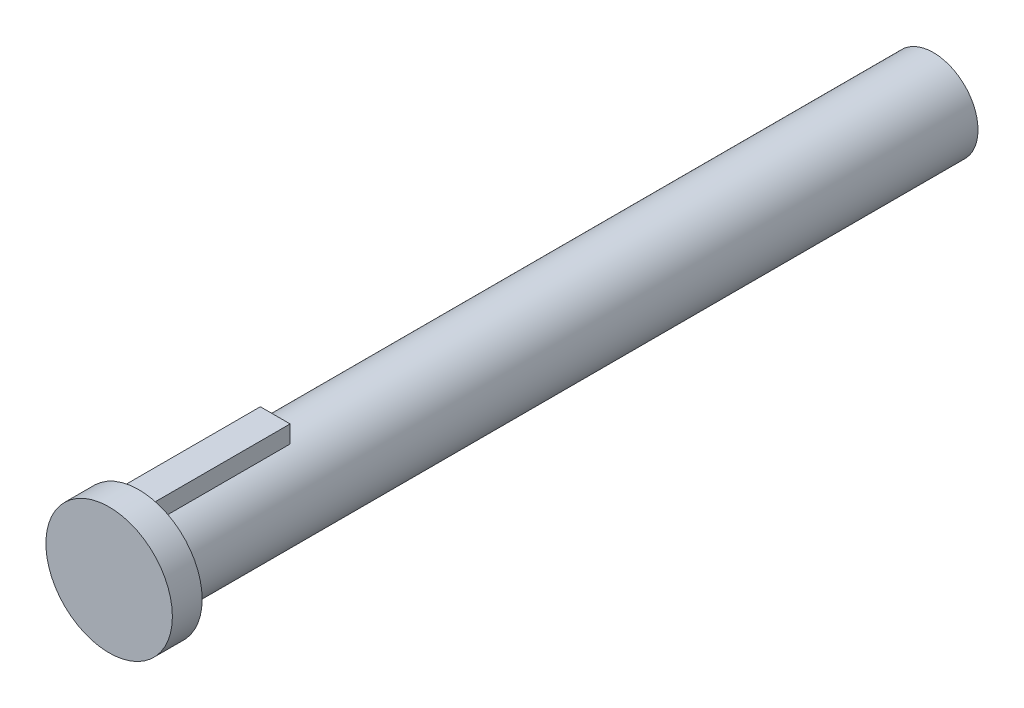
ISO-10303-21;
HEADER;
FILE_DESCRIPTION(('STEP AP214'),'2;1');
FILE_NAME('part.step','',(''),(''),'','','');
FILE_SCHEMA(('AUTOMOTIVE_DESIGN { 1 0 10303 214 1 1 1 1 }'));
ENDSEC;
DATA;
#1=APPLICATION_CONTEXT('core data for automotive mechanical design processes');
#2=APPLICATION_PROTOCOL_DEFINITION('international standard','automotive_design',2000,#1);
#3=PRODUCT_CONTEXT('',#1,'mechanical');
#4=PRODUCT('Part','Part','',(#3));
#5=PRODUCT_RELATED_PRODUCT_CATEGORY('part','',(#4));
#6=PRODUCT_DEFINITION_FORMATION('','',#4);
#7=PRODUCT_DEFINITION_CONTEXT('part definition',#1,'design');
#8=PRODUCT_DEFINITION('design','',#6,#7);
#9=PRODUCT_DEFINITION_SHAPE('','',#8);
#10=(LENGTH_UNIT() NAMED_UNIT(*) SI_UNIT(.MILLI.,.METRE.));
#11=(NAMED_UNIT(*) PLANE_ANGLE_UNIT() SI_UNIT($,.RADIAN.));
#12=(NAMED_UNIT(*) SI_UNIT($,.STERADIAN.) SOLID_ANGLE_UNIT());
#13=UNCERTAINTY_MEASURE_WITH_UNIT(LENGTH_MEASURE(1.E-05),#10,'distance_accuracy_value','');
#14=(GEOMETRIC_REPRESENTATION_CONTEXT(3) GLOBAL_UNCERTAINTY_ASSIGNED_CONTEXT((#13)) GLOBAL_UNIT_ASSIGNED_CONTEXT((#10,
#11,#12)) REPRESENTATION_CONTEXT('',''));
#15=CARTESIAN_POINT('',(0.,0.,0.));
#16=DIRECTION('',(0.,0.,1.));
#17=DIRECTION('',(1.,0.,0.));
#18=AXIS2_PLACEMENT_3D('',#15,#16,#17);
#19=CARTESIAN_POINT('',(0.,0.,53.38));
#20=DIRECTION('',(0.,0.,-1.));
#21=DIRECTION('',(-1.,0.,0.));
#22=AXIS2_PLACEMENT_3D('',#19,#20,#21);
#23=CYLINDRICAL_SURFACE('',#22,3.);
#24=CARTESIAN_POINT('',(0.,0.,53.38));
#25=DIRECTION('',(0.,0.,1.));
#26=DIRECTION('',(1.,0.,0.));
#27=AXIS2_PLACEMENT_3D('',#24,#25,#26);
#28=CIRCLE('',#27,3.);
#29=CARTESIAN_POINT('',(-1.,2.82842712474619,53.38));
#30=VERTEX_POINT('',#29);
#31=CARTESIAN_POINT('',(1.,2.82842712474619,53.38));
#32=VERTEX_POINT('',#31);
#33=EDGE_CURVE('E43',#30,#32,#28,.T.);
#34=ORIENTED_EDGE('',*,*,#33,.F.);
#35=DIRECTION('',(0.,0.,1.));
#36=VECTOR('',#35,1.);
#37=CARTESIAN_POINT('',(-1.,2.82842712474619,44.22));
#38=LINE('',#37,#36);
#39=CARTESIAN_POINT('',(-1.,2.82842712474619,44.22));
#40=VERTEX_POINT('',#39);
#41=EDGE_CURVE('E83',#40,#30,#38,.T.);
#42=ORIENTED_EDGE('',*,*,#41,.F.);
#43=CARTESIAN_POINT('',(0.,0.,44.22));
#44=DIRECTION('',(0.,0.,-1.));
#45=DIRECTION('',(-1.,0.,0.));
#46=AXIS2_PLACEMENT_3D('',#43,#44,#45);
#47=CIRCLE('',#46,3.);
#48=CARTESIAN_POINT('',(1.,2.82842712474619,44.22));
#49=VERTEX_POINT('',#48);
#50=EDGE_CURVE('E11',#40,#49,#47,.T.);
#51=ORIENTED_EDGE('',*,*,#50,.T.);
#52=DIRECTION('',(0.,0.,1.));
#53=VECTOR('',#52,1.);
#54=CARTESIAN_POINT('',(1.,2.82842712474619,44.22));
#55=LINE('',#54,#53);
#56=EDGE_CURVE('E75',#49,#32,#55,.T.);
#57=ORIENTED_EDGE('',*,*,#56,.T.);
#58=EDGE_LOOP('',(#34,#42,#51,#57));
#59=FACE_BOUND('',#58,.T.);
#60=CARTESIAN_POINT('',(0.,0.,0.));
#61=DIRECTION('',(0.,0.,1.));
#62=DIRECTION('',(1.,0.,0.));
#63=AXIS2_PLACEMENT_3D('',#60,#61,#62);
#64=CIRCLE('',#63,3.);
#65=CARTESIAN_POINT('',(3.,0.,0.));
#66=VERTEX_POINT('',#65);
#67=EDGE_CURVE('E87',#66,#66,#64,.T.);
#68=ORIENTED_EDGE('',*,*,#67,.T.);
#69=EDGE_LOOP('',(#68));
#70=FACE_BOUND('',#69,.T.);
#71=ADVANCED_FACE('F35',(#59,#70),#23,.T.);
#72=CARTESIAN_POINT('',(0.,0.,0.));
#73=DIRECTION('',(0.,0.,1.));
#74=DIRECTION('',(1.,0.,0.));
#75=AXIS2_PLACEMENT_3D('',#72,#73,#74);
#76=PLANE('',#75);
#77=ORIENTED_EDGE('',*,*,#67,.F.);
#78=EDGE_LOOP('',(#77));
#79=FACE_BOUND('',#78,.T.);
#80=ADVANCED_FACE('F110',(#79),#76,.F.);
#81=CARTESIAN_POINT('',(-1.,2.82842712474619,44.22));
#82=DIRECTION('',(-1.,0.,0.));
#83=DIRECTION('',(0.,0.,1.));
#84=AXIS2_PLACEMENT_3D('',#81,#82,#83);
#85=PLANE('',#84);
#86=DIRECTION('',(0.,-1.,0.));
#87=VECTOR('',#86,1.);
#88=CARTESIAN_POINT('',(-1.,2.82842712474619,53.38));
#89=LINE('',#88,#87);
#90=CARTESIAN_POINT('',(-1.,3.99842712474619,53.38));
#91=VERTEX_POINT('',#90);
#92=EDGE_CURVE('E91',#91,#30,#89,.T.);
#93=ORIENTED_EDGE('',*,*,#92,.F.);
#94=DIRECTION('',(0.,0.,1.));
#95=VECTOR('',#94,1.);
#96=CARTESIAN_POINT('',(-1.,3.99842712474619,44.22));
#97=LINE('',#96,#95);
#98=CARTESIAN_POINT('',(-1.,3.99842712474619,44.22));
#99=VERTEX_POINT('',#98);
#100=EDGE_CURVE('E70',#99,#91,#97,.T.);
#101=ORIENTED_EDGE('',*,*,#100,.F.);
#102=DIRECTION('',(0.,-1.,0.));
#103=VECTOR('',#102,1.);
#104=CARTESIAN_POINT('',(-1.,2.82842712474619,44.22));
#105=LINE('',#104,#103);
#106=EDGE_CURVE('E93',#99,#40,#105,.T.);
#107=ORIENTED_EDGE('',*,*,#106,.T.);
#108=ORIENTED_EDGE('',*,*,#41,.T.);
#109=EDGE_LOOP('',(#93,#101,#107,#108));
#110=FACE_BOUND('',#109,.T.);
#111=ADVANCED_FACE('F90',(#110),#85,.T.);
#112=CARTESIAN_POINT('',(-1.,3.99842712474619,44.22));
#113=DIRECTION('',(0.,1.,0.));
#114=DIRECTION('',(0.,0.,1.));
#115=AXIS2_PLACEMENT_3D('',#112,#113,#114);
#116=PLANE('',#115);
#117=DIRECTION('',(-1.,0.,0.));
#118=VECTOR('',#117,1.);
#119=CARTESIAN_POINT('',(-1.,3.99842712474619,53.38));
#120=LINE('',#119,#118);
#121=CARTESIAN_POINT('',(1.,3.99842712474619,53.38));
#122=VERTEX_POINT('',#121);
#123=EDGE_CURVE('E96',#122,#91,#120,.T.);
#124=ORIENTED_EDGE('',*,*,#123,.F.);
#125=DIRECTION('',(0.,0.,1.));
#126=VECTOR('',#125,1.);
#127=CARTESIAN_POINT('',(1.,3.99842712474619,44.22));
#128=LINE('',#127,#126);
#129=CARTESIAN_POINT('',(1.,3.99842712474619,44.22));
#130=VERTEX_POINT('',#129);
#131=EDGE_CURVE('E64',#130,#122,#128,.T.);
#132=ORIENTED_EDGE('',*,*,#131,.F.);
#133=DIRECTION('',(-1.,0.,0.));
#134=VECTOR('',#133,1.);
#135=CARTESIAN_POINT('',(-1.,3.99842712474619,44.22));
#136=LINE('',#135,#134);
#137=EDGE_CURVE('E99',#130,#99,#136,.T.);
#138=ORIENTED_EDGE('',*,*,#137,.T.);
#139=ORIENTED_EDGE('',*,*,#100,.T.);
#140=EDGE_LOOP('',(#124,#132,#138,#139));
#141=FACE_BOUND('',#140,.T.);
#142=ADVANCED_FACE('F117',(#141),#116,.T.);
#143=CARTESIAN_POINT('',(1.,3.99842712474619,44.22));
#144=DIRECTION('',(1.,0.,0.));
#145=DIRECTION('',(0.,1.,0.));
#146=AXIS2_PLACEMENT_3D('',#143,#144,#145);
#147=PLANE('',#146);
#148=DIRECTION('',(0.,1.,0.));
#149=VECTOR('',#148,1.);
#150=CARTESIAN_POINT('',(1.,3.99842712474619,53.38));
#151=LINE('',#150,#149);
#152=EDGE_CURVE('E101',#32,#122,#151,.T.);
#153=ORIENTED_EDGE('',*,*,#152,.F.);
#154=ORIENTED_EDGE('',*,*,#56,.F.);
#155=DIRECTION('',(0.,1.,0.));
#156=VECTOR('',#155,1.);
#157=CARTESIAN_POINT('',(1.,3.99842712474619,44.22));
#158=LINE('',#157,#156);
#159=EDGE_CURVE('E97',#49,#130,#158,.T.);
#160=ORIENTED_EDGE('',*,*,#159,.T.);
#161=ORIENTED_EDGE('',*,*,#131,.T.);
#162=EDGE_LOOP('',(#153,#154,#160,#161));
#163=FACE_BOUND('',#162,.T.);
#164=ADVANCED_FACE('F121',(#163),#147,.T.);
#165=CARTESIAN_POINT('',(0.,0.,44.22));
#166=DIRECTION('',(0.,0.,-1.));
#167=DIRECTION('',(-1.,0.,0.));
#168=AXIS2_PLACEMENT_3D('',#165,#166,#167);
#169=PLANE('',#168);
#170=ORIENTED_EDGE('',*,*,#50,.F.);
#171=ORIENTED_EDGE('',*,*,#106,.F.);
#172=ORIENTED_EDGE('',*,*,#137,.F.);
#173=ORIENTED_EDGE('',*,*,#159,.F.);
#174=EDGE_LOOP('',(#170,#171,#172,#173));
#175=FACE_BOUND('',#174,.T.);
#176=ADVANCED_FACE('F124',(#175),#169,.T.);
#177=CARTESIAN_POINT('',(0.,0.,53.38));
#178=DIRECTION('',(0.,0.,1.));
#179=DIRECTION('',(1.,0.,0.));
#180=AXIS2_PLACEMENT_3D('',#177,#178,#179);
#181=PLANE('',#180);
#182=CARTESIAN_POINT('',(0.,0.,53.38));
#183=DIRECTION('',(0.,0.,1.));
#184=DIRECTION('',(1.,0.,0.));
#185=AXIS2_PLACEMENT_3D('',#182,#183,#184);
#186=CIRCLE('',#185,4.25);
#187=CARTESIAN_POINT('',(4.25,0.,53.38));
#188=VERTEX_POINT('',#187);
#189=EDGE_CURVE('E144',#188,#188,#186,.T.);
#190=ORIENTED_EDGE('',*,*,#189,.F.);
#191=EDGE_LOOP('',(#190));
#192=FACE_BOUND('',#191,.T.);
#193=ORIENTED_EDGE('',*,*,#92,.T.);
#194=ORIENTED_EDGE('',*,*,#33,.T.);
#195=ORIENTED_EDGE('',*,*,#152,.T.);
#196=ORIENTED_EDGE('',*,*,#123,.T.);
#197=EDGE_LOOP('',(#193,#194,#195,#196));
#198=FACE_BOUND('',#197,.T.);
#199=ADVANCED_FACE('F95',(#192,#198),#181,.F.);
#200=CARTESIAN_POINT('',(0.,0.,55.38));
#201=DIRECTION('',(0.,0.,-1.));
#202=DIRECTION('',(-1.,0.,0.));
#203=AXIS2_PLACEMENT_3D('',#200,#201,#202);
#204=CYLINDRICAL_SURFACE('',#203,4.25);
#205=CARTESIAN_POINT('',(0.,0.,55.38));
#206=DIRECTION('',(0.,0.,1.));
#207=DIRECTION('',(1.,0.,0.));
#208=AXIS2_PLACEMENT_3D('',#205,#206,#207);
#209=CIRCLE('',#208,4.25);
#210=CARTESIAN_POINT('',(4.25,0.,55.38));
#211=VERTEX_POINT('',#210);
#212=EDGE_CURVE('E143',#211,#211,#209,.T.);
#213=ORIENTED_EDGE('',*,*,#212,.F.);
#214=EDGE_LOOP('',(#213));
#215=FACE_BOUND('',#214,.T.);
#216=ORIENTED_EDGE('',*,*,#189,.T.);
#217=EDGE_LOOP('',(#216));
#218=FACE_BOUND('',#217,.T.);
#219=ADVANCED_FACE('F129',(#215,#218),#204,.T.);
#220=CARTESIAN_POINT('',(0.,0.,55.38));
#221=DIRECTION('',(0.,0.,1.));
#222=DIRECTION('',(1.,0.,0.));
#223=AXIS2_PLACEMENT_3D('',#220,#221,#222);
#224=PLANE('',#223);
#225=ORIENTED_EDGE('',*,*,#212,.T.);
#226=EDGE_LOOP('',(#225));
#227=FACE_BOUND('',#226,.T.);
#228=ADVANCED_FACE('F132',(#227),#224,.T.);
#229=CLOSED_SHELL('',(#71,#80,#111,#142,#164,#176,#199,#219,#228));
#230=MANIFOLD_SOLID_BREP('B2',#229);
#231=ADVANCED_BREP_SHAPE_REPRESENTATION('',(#18,#230),#14);
#232=SHAPE_DEFINITION_REPRESENTATION(#9,#231);
ENDSEC;
END-ISO-10303-21;
